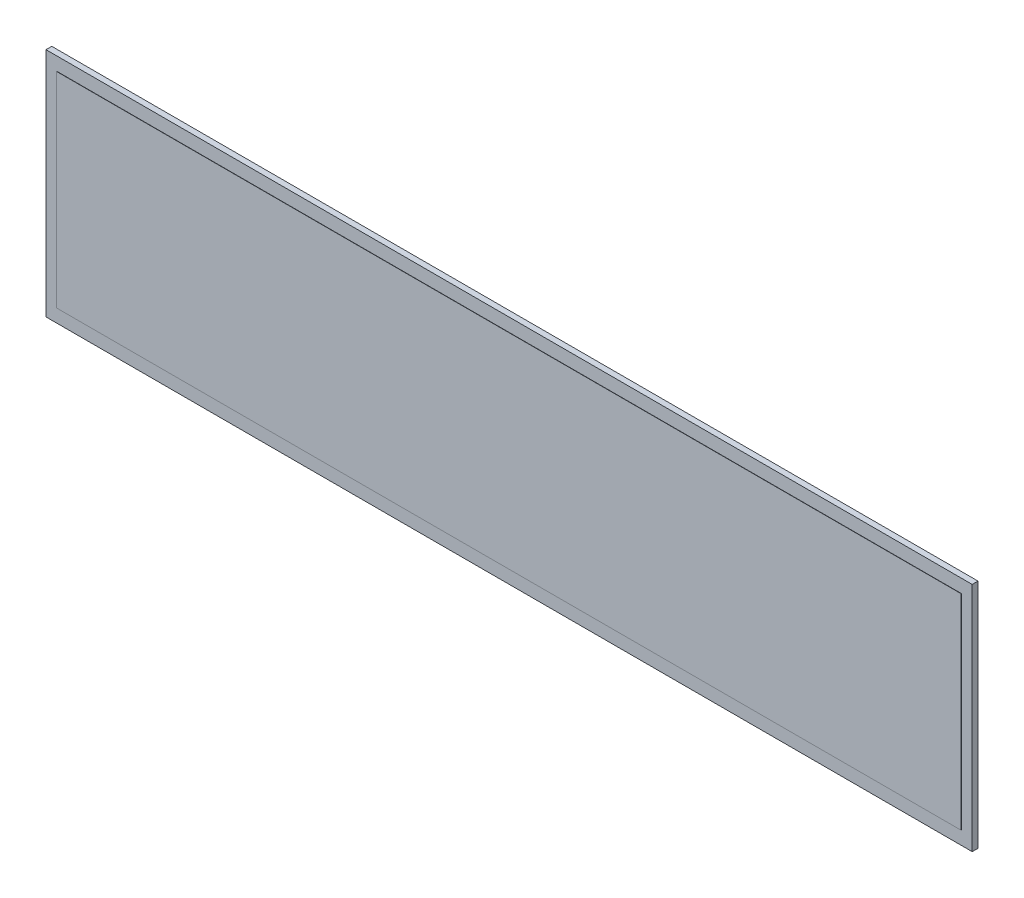
ISO-10303-21;
HEADER;
FILE_DESCRIPTION(('STEP AP214'),'2;1');
FILE_NAME('part.step','',(''),(''),'','','');
FILE_SCHEMA(('AUTOMOTIVE_DESIGN { 1 0 10303 214 1 1 1 1 }'));
ENDSEC;
DATA;
#1=APPLICATION_CONTEXT('core data for automotive mechanical design processes');
#2=APPLICATION_PROTOCOL_DEFINITION('international standard','automotive_design',2000,#1);
#3=PRODUCT_CONTEXT('',#1,'mechanical');
#4=PRODUCT('Part','Part','',(#3));
#5=PRODUCT_RELATED_PRODUCT_CATEGORY('part','',(#4));
#6=PRODUCT_DEFINITION_FORMATION('','',#4);
#7=PRODUCT_DEFINITION_CONTEXT('part definition',#1,'design');
#8=PRODUCT_DEFINITION('design','',#6,#7);
#9=PRODUCT_DEFINITION_SHAPE('','',#8);
#10=(LENGTH_UNIT() NAMED_UNIT(*) SI_UNIT(.MILLI.,.METRE.));
#11=(NAMED_UNIT(*) PLANE_ANGLE_UNIT() SI_UNIT($,.RADIAN.));
#12=(NAMED_UNIT(*) SI_UNIT($,.STERADIAN.) SOLID_ANGLE_UNIT());
#13=UNCERTAINTY_MEASURE_WITH_UNIT(LENGTH_MEASURE(1.E-05),#10,'distance_accuracy_value','');
#14=(GEOMETRIC_REPRESENTATION_CONTEXT(3) GLOBAL_UNCERTAINTY_ASSIGNED_CONTEXT((#13)) GLOBAL_UNIT_ASSIGNED_CONTEXT((#10,
#11,#12)) REPRESENTATION_CONTEXT('',''));
#15=CARTESIAN_POINT('',(0.,0.,0.));
#16=DIRECTION('',(0.,0.,1.));
#17=DIRECTION('',(1.,0.,0.));
#18=AXIS2_PLACEMENT_3D('',#15,#16,#17);
#19=CARTESIAN_POINT('',(0.,0.,2.15900000000002));
#20=DIRECTION('',(0.,0.,-1.));
#21=DIRECTION('',(-1.,0.,0.));
#22=AXIS2_PLACEMENT_3D('',#19,#20,#21);
#23=PLANE('',#22);
#24=DIRECTION('',(0.,-1.,0.));
#25=VECTOR('',#24,1.);
#26=CARTESIAN_POINT('',(-344.551,86.1059999999999,2.15900000000002));
#27=LINE('',#26,#25);
#28=CARTESIAN_POINT('',(-344.551,86.1059999999999,2.15900000000002));
#29=VERTEX_POINT('',#28);
#30=CARTESIAN_POINT('',(-344.551,-86.106,2.15900000000002));
#31=VERTEX_POINT('',#30);
#32=EDGE_CURVE('E126',#29,#31,#27,.T.);
#33=ORIENTED_EDGE('',*,*,#32,.T.);
#34=DIRECTION('',(1.,0.,0.));
#35=VECTOR('',#34,1.);
#36=CARTESIAN_POINT('',(344.551,-86.106,2.15900000000002));
#37=LINE('',#36,#35);
#38=CARTESIAN_POINT('',(344.551,-86.106,2.15900000000002));
#39=VERTEX_POINT('',#38);
#40=EDGE_CURVE('E129',#31,#39,#37,.T.);
#41=ORIENTED_EDGE('',*,*,#40,.T.);
#42=DIRECTION('',(0.,1.,0.));
#43=VECTOR('',#42,1.);
#44=CARTESIAN_POINT('',(344.551,86.106,2.15900000000002));
#45=LINE('',#44,#43);
#46=CARTESIAN_POINT('',(344.551,86.106,2.15900000000002));
#47=VERTEX_POINT('',#46);
#48=EDGE_CURVE('E132',#39,#47,#45,.T.);
#49=ORIENTED_EDGE('',*,*,#48,.T.);
#50=DIRECTION('',(-1.,0.,0.));
#51=VECTOR('',#50,1.);
#52=CARTESIAN_POINT('',(344.551,86.106,2.15900000000002));
#53=LINE('',#52,#51);
#54=EDGE_CURVE('E134',#47,#29,#53,.T.);
#55=ORIENTED_EDGE('',*,*,#54,.T.);
#56=EDGE_LOOP('',(#33,#41,#49,#55));
#57=FACE_BOUND('',#56,.T.);
#58=DIRECTION('',(0.,-1.,0.));
#59=VECTOR('',#58,1.);
#60=CARTESIAN_POINT('',(-336.55,76.2,2.15900000000002));
#61=LINE('',#60,#59);
#62=CARTESIAN_POINT('',(-336.55,76.2,2.15900000000002));
#63=VERTEX_POINT('',#62);
#64=CARTESIAN_POINT('',(-336.55,-76.2,2.15900000000002));
#65=VERTEX_POINT('',#64);
#66=EDGE_CURVE('E47',#63,#65,#61,.T.);
#67=ORIENTED_EDGE('',*,*,#66,.F.);
#68=DIRECTION('',(-1.,0.,0.));
#69=VECTOR('',#68,1.);
#70=CARTESIAN_POINT('',(336.55,76.2000000000001,2.15900000000002));
#71=LINE('',#70,#69);
#72=CARTESIAN_POINT('',(336.55,76.2000000000001,2.15900000000002));
#73=VERTEX_POINT('',#72);
#74=EDGE_CURVE('E51',#73,#63,#71,.T.);
#75=ORIENTED_EDGE('',*,*,#74,.F.);
#76=DIRECTION('',(0.,1.,0.));
#77=VECTOR('',#76,1.);
#78=CARTESIAN_POINT('',(336.55,76.2000000000001,2.15900000000002));
#79=LINE('',#78,#77);
#80=CARTESIAN_POINT('',(336.55,-76.1999999999999,2.15900000000002));
#81=VERTEX_POINT('',#80);
#82=EDGE_CURVE('E259',#81,#73,#79,.T.);
#83=ORIENTED_EDGE('',*,*,#82,.F.);
#84=DIRECTION('',(1.,0.,0.));
#85=VECTOR('',#84,1.);
#86=CARTESIAN_POINT('',(336.55,-76.1999999999999,2.15900000000002));
#87=LINE('',#86,#85);
#88=EDGE_CURVE('E265',#65,#81,#87,.T.);
#89=ORIENTED_EDGE('',*,*,#88,.F.);
#90=EDGE_LOOP('',(#67,#75,#83,#89));
#91=FACE_BOUND('',#90,.T.);
#92=ADVANCED_FACE('F32',(#57,#91),#23,.F.);
#93=CARTESIAN_POINT('',(-344.551,86.1059999999999,2.15900000000002));
#94=DIRECTION('',(1.,0.,0.));
#95=DIRECTION('',(0.,0.,-1.));
#96=AXIS2_PLACEMENT_3D('',#93,#94,#95);
#97=PLANE('',#96);
#98=DIRECTION('',(0.,-1.,0.));
#99=VECTOR('',#98,1.);
#100=CARTESIAN_POINT('',(-344.551,86.106,-2.15899999999991));
#101=LINE('',#100,#99);
#102=CARTESIAN_POINT('',(-344.551,86.106,-2.15899999999991));
#103=VERTEX_POINT('',#102);
#104=CARTESIAN_POINT('',(-344.551,-86.1060000000001,-2.15899999999997));
#105=VERTEX_POINT('',#104);
#106=EDGE_CURVE('E117',#103,#105,#101,.T.);
#107=ORIENTED_EDGE('',*,*,#106,.T.);
#108=DIRECTION('',(0.,0.,-1.));
#109=VECTOR('',#108,1.);
#110=CARTESIAN_POINT('',(-344.551,-86.106,2.15900000000002));
#111=LINE('',#110,#109);
#112=EDGE_CURVE('E11',#31,#105,#111,.T.);
#113=ORIENTED_EDGE('',*,*,#112,.F.);
#114=ORIENTED_EDGE('',*,*,#32,.F.);
#115=DIRECTION('',(0.,0.,-1.));
#116=VECTOR('',#115,1.);
#117=CARTESIAN_POINT('',(-344.551,86.1059999999999,2.15900000000002));
#118=LINE('',#117,#116);
#119=EDGE_CURVE('E135',#29,#103,#118,.T.);
#120=ORIENTED_EDGE('',*,*,#119,.T.);
#121=EDGE_LOOP('',(#107,#113,#114,#120));
#122=FACE_BOUND('',#121,.T.);
#123=ADVANCED_FACE('F34',(#122),#97,.F.);
#124=CARTESIAN_POINT('',(344.551,-86.106,2.15900000000002));
#125=DIRECTION('',(0.,1.,0.));
#126=DIRECTION('',(-1.,0.,0.));
#127=AXIS2_PLACEMENT_3D('',#124,#125,#126);
#128=PLANE('',#127);
#129=DIRECTION('',(1.,0.,0.));
#130=VECTOR('',#129,1.);
#131=CARTESIAN_POINT('',(344.551,-86.106,-2.15900000000002));
#132=LINE('',#131,#130);
#133=CARTESIAN_POINT('',(344.551,-86.106,-2.15900000000002));
#134=VERTEX_POINT('',#133);
#135=EDGE_CURVE('E120',#105,#134,#132,.T.);
#136=ORIENTED_EDGE('',*,*,#135,.T.);
#137=DIRECTION('',(0.,0.,-1.));
#138=VECTOR('',#137,1.);
#139=CARTESIAN_POINT('',(344.551,-86.106,2.15900000000002));
#140=LINE('',#139,#138);
#141=EDGE_CURVE('E40',#39,#134,#140,.T.);
#142=ORIENTED_EDGE('',*,*,#141,.F.);
#143=ORIENTED_EDGE('',*,*,#40,.F.);
#144=ORIENTED_EDGE('',*,*,#112,.T.);
#145=EDGE_LOOP('',(#136,#142,#143,#144));
#146=FACE_BOUND('',#145,.T.);
#147=ADVANCED_FACE('F165',(#146),#128,.F.);
#148=CARTESIAN_POINT('',(344.551,86.106,2.15900000000002));
#149=DIRECTION('',(-1.,0.,0.));
#150=DIRECTION('',(0.,0.,1.));
#151=AXIS2_PLACEMENT_3D('',#148,#149,#150);
#152=PLANE('',#151);
#153=DIRECTION('',(0.,1.,0.));
#154=VECTOR('',#153,1.);
#155=CARTESIAN_POINT('',(344.551,86.1060000000001,-2.15899999999997));
#156=LINE('',#155,#154);
#157=CARTESIAN_POINT('',(344.551,86.1060000000001,-2.15899999999997));
#158=VERTEX_POINT('',#157);
#159=EDGE_CURVE('E138',#134,#158,#156,.T.);
#160=ORIENTED_EDGE('',*,*,#159,.T.);
#161=DIRECTION('',(0.,0.,-1.));
#162=VECTOR('',#161,1.);
#163=CARTESIAN_POINT('',(344.551,86.106,2.15900000000002));
#164=LINE('',#163,#162);
#165=EDGE_CURVE('E143',#47,#158,#164,.T.);
#166=ORIENTED_EDGE('',*,*,#165,.F.);
#167=ORIENTED_EDGE('',*,*,#48,.F.);
#168=ORIENTED_EDGE('',*,*,#141,.T.);
#169=EDGE_LOOP('',(#160,#166,#167,#168));
#170=FACE_BOUND('',#169,.T.);
#171=ADVANCED_FACE('F150',(#170),#152,.F.);
#172=CARTESIAN_POINT('',(344.551,86.106,2.15900000000002));
#173=DIRECTION('',(0.,-1.,0.));
#174=DIRECTION('',(1.,0.,0.));
#175=AXIS2_PLACEMENT_3D('',#172,#173,#174);
#176=PLANE('',#175);
#177=DIRECTION('',(-1.,0.,0.));
#178=VECTOR('',#177,1.);
#179=CARTESIAN_POINT('',(344.551,86.1060000000001,-2.15899999999997));
#180=LINE('',#179,#178);
#181=EDGE_CURVE('E130',#158,#103,#180,.T.);
#182=ORIENTED_EDGE('',*,*,#181,.T.);
#183=ORIENTED_EDGE('',*,*,#119,.F.);
#184=ORIENTED_EDGE('',*,*,#54,.F.);
#185=ORIENTED_EDGE('',*,*,#165,.T.);
#186=EDGE_LOOP('',(#182,#183,#184,#185));
#187=FACE_BOUND('',#186,.T.);
#188=ADVANCED_FACE('F159',(#187),#176,.F.);
#189=CARTESIAN_POINT('',(0.,0.,-2.15899999999997));
#190=DIRECTION('',(0.,0.,-1.));
#191=DIRECTION('',(-1.,0.,0.));
#192=AXIS2_PLACEMENT_3D('',#189,#190,#191);
#193=PLANE('',#192);
#194=ORIENTED_EDGE('',*,*,#106,.F.);
#195=ORIENTED_EDGE('',*,*,#181,.F.);
#196=ORIENTED_EDGE('',*,*,#159,.F.);
#197=ORIENTED_EDGE('',*,*,#135,.F.);
#198=EDGE_LOOP('',(#194,#195,#196,#197));
#199=FACE_BOUND('',#198,.T.);
#200=ADVANCED_FACE('F156',(#199),#193,.T.);
#201=CARTESIAN_POINT('',(-336.55,76.2,2.36220000000002));
#202=DIRECTION('',(1.,0.,0.));
#203=DIRECTION('',(0.,0.,-1.));
#204=AXIS2_PLACEMENT_3D('',#201,#202,#203);
#205=PLANE('',#204);
#206=ORIENTED_EDGE('',*,*,#66,.T.);
#207=DIRECTION('',(0.,0.,-1.));
#208=VECTOR('',#207,1.);
#209=CARTESIAN_POINT('',(-336.55,-76.2,2.36220000000002));
#210=LINE('',#209,#208);
#211=CARTESIAN_POINT('',(-336.55,-76.2,2.36220000000002));
#212=VERTEX_POINT('',#211);
#213=EDGE_CURVE('E100',#212,#65,#210,.T.);
#214=ORIENTED_EDGE('',*,*,#213,.F.);
#215=DIRECTION('',(0.,-1.,0.));
#216=VECTOR('',#215,1.);
#217=CARTESIAN_POINT('',(-336.55,76.2,2.36220000000002));
#218=LINE('',#217,#216);
#219=CARTESIAN_POINT('',(-336.55,76.2,2.36220000000002));
#220=VERTEX_POINT('',#219);
#221=EDGE_CURVE('E106',#220,#212,#218,.T.);
#222=ORIENTED_EDGE('',*,*,#221,.F.);
#223=DIRECTION('',(0.,0.,-1.));
#224=VECTOR('',#223,1.);
#225=CARTESIAN_POINT('',(-336.55,76.2,2.36220000000002));
#226=LINE('',#225,#224);
#227=EDGE_CURVE('E257',#220,#63,#226,.T.);
#228=ORIENTED_EDGE('',*,*,#227,.T.);
#229=EDGE_LOOP('',(#206,#214,#222,#228));
#230=FACE_BOUND('',#229,.T.);
#231=ADVANCED_FACE('F116',(#230),#205,.F.);
#232=CARTESIAN_POINT('',(336.55,-76.1999999999999,2.36220000000002));
#233=DIRECTION('',(0.,1.,0.));
#234=DIRECTION('',(-1.,0.,0.));
#235=AXIS2_PLACEMENT_3D('',#232,#233,#234);
#236=PLANE('',#235);
#237=ORIENTED_EDGE('',*,*,#88,.T.);
#238=DIRECTION('',(0.,0.,-1.));
#239=VECTOR('',#238,1.);
#240=CARTESIAN_POINT('',(336.55,-76.1999999999999,2.36220000000002));
#241=LINE('',#240,#239);
#242=CARTESIAN_POINT('',(336.55,-76.1999999999999,2.36220000000002));
#243=VERTEX_POINT('',#242);
#244=EDGE_CURVE('E102',#243,#81,#241,.T.);
#245=ORIENTED_EDGE('',*,*,#244,.F.);
#246=DIRECTION('',(1.,0.,0.));
#247=VECTOR('',#246,1.);
#248=CARTESIAN_POINT('',(336.55,-76.1999999999999,2.36220000000002));
#249=LINE('',#248,#247);
#250=EDGE_CURVE('E95',#212,#243,#249,.T.);
#251=ORIENTED_EDGE('',*,*,#250,.F.);
#252=ORIENTED_EDGE('',*,*,#213,.T.);
#253=EDGE_LOOP('',(#237,#245,#251,#252));
#254=FACE_BOUND('',#253,.T.);
#255=ADVANCED_FACE('F98',(#254),#236,.F.);
#256=CARTESIAN_POINT('',(336.55,76.2000000000001,2.36220000000002));
#257=DIRECTION('',(-1.,0.,0.));
#258=DIRECTION('',(0.,0.,1.));
#259=AXIS2_PLACEMENT_3D('',#256,#257,#258);
#260=PLANE('',#259);
#261=ORIENTED_EDGE('',*,*,#82,.T.);
#262=DIRECTION('',(0.,0.,-1.));
#263=VECTOR('',#262,1.);
#264=CARTESIAN_POINT('',(336.55,76.2000000000001,2.36220000000002));
#265=LINE('',#264,#263);
#266=CARTESIAN_POINT('',(336.55,76.2000000000001,2.36220000000002));
#267=VERTEX_POINT('',#266);
#268=EDGE_CURVE('E122',#267,#73,#265,.T.);
#269=ORIENTED_EDGE('',*,*,#268,.F.);
#270=DIRECTION('',(0.,1.,0.));
#271=VECTOR('',#270,1.);
#272=CARTESIAN_POINT('',(336.55,76.2000000000001,2.36220000000002));
#273=LINE('',#272,#271);
#274=EDGE_CURVE('E105',#243,#267,#273,.T.);
#275=ORIENTED_EDGE('',*,*,#274,.F.);
#276=ORIENTED_EDGE('',*,*,#244,.T.);
#277=EDGE_LOOP('',(#261,#269,#275,#276));
#278=FACE_BOUND('',#277,.T.);
#279=ADVANCED_FACE('F204',(#278),#260,.F.);
#280=CARTESIAN_POINT('',(336.55,76.2000000000001,2.36220000000002));
#281=DIRECTION('',(0.,-1.,0.));
#282=DIRECTION('',(1.,0.,0.));
#283=AXIS2_PLACEMENT_3D('',#280,#281,#282);
#284=PLANE('',#283);
#285=ORIENTED_EDGE('',*,*,#74,.T.);
#286=ORIENTED_EDGE('',*,*,#227,.F.);
#287=DIRECTION('',(-1.,0.,0.));
#288=VECTOR('',#287,1.);
#289=CARTESIAN_POINT('',(336.55,76.2000000000001,2.36220000000002));
#290=LINE('',#289,#288);
#291=EDGE_CURVE('E111',#267,#220,#290,.T.);
#292=ORIENTED_EDGE('',*,*,#291,.F.);
#293=ORIENTED_EDGE('',*,*,#268,.T.);
#294=EDGE_LOOP('',(#285,#286,#292,#293));
#295=FACE_BOUND('',#294,.T.);
#296=ADVANCED_FACE('F210',(#295),#284,.F.);
#297=CARTESIAN_POINT('',(0.,0.,2.36220000000002));
#298=DIRECTION('',(0.,0.,-1.));
#299=DIRECTION('',(-1.,0.,0.));
#300=AXIS2_PLACEMENT_3D('',#297,#298,#299);
#301=PLANE('',#300);
#302=ORIENTED_EDGE('',*,*,#221,.T.);
#303=ORIENTED_EDGE('',*,*,#250,.T.);
#304=ORIENTED_EDGE('',*,*,#274,.T.);
#305=ORIENTED_EDGE('',*,*,#291,.T.);
#306=EDGE_LOOP('',(#302,#303,#304,#305));
#307=FACE_BOUND('',#306,.T.);
#308=ADVANCED_FACE('F109',(#307),#301,.F.);
#309=CLOSED_SHELL('',(#92,#123,#147,#171,#188,#200,#231,#255,#279,#296,#308));
#310=MANIFOLD_SOLID_BREP('B2',#309);
#311=ADVANCED_BREP_SHAPE_REPRESENTATION('',(#18,#310),#14);
#312=SHAPE_DEFINITION_REPRESENTATION(#9,#311);
ENDSEC;
END-ISO-10303-21;
